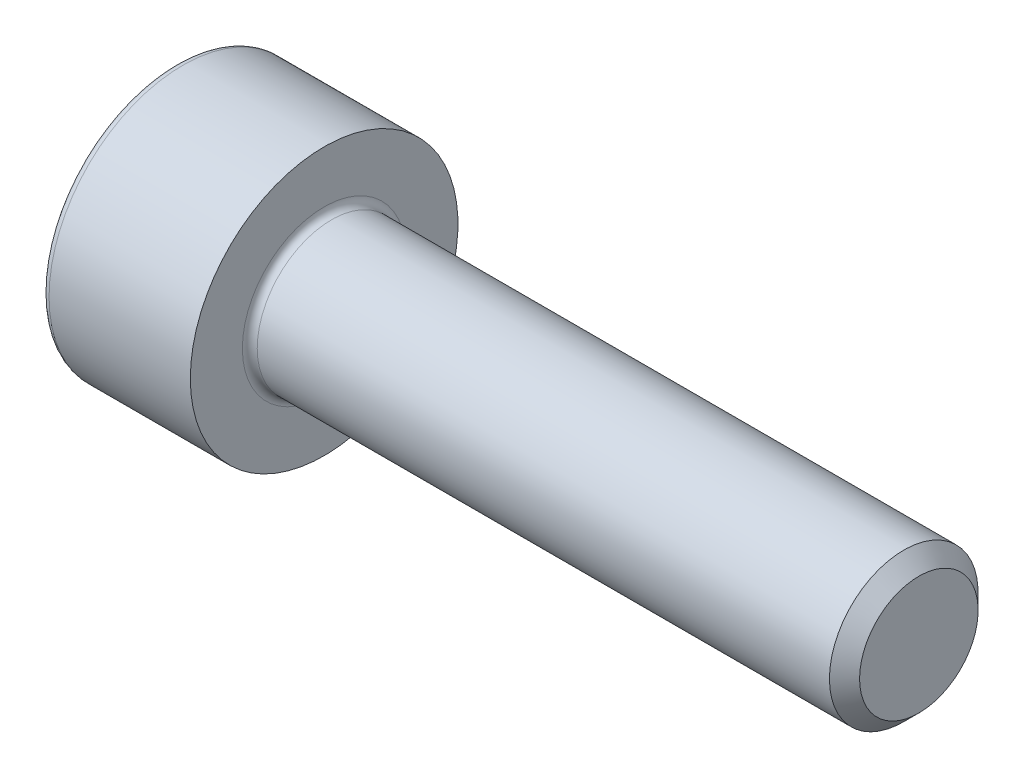
ISO-10303-21;
HEADER;
FILE_DESCRIPTION(('STEP AP214'),'2;1');
FILE_NAME('part.step','',(''),(''),'','','');
FILE_SCHEMA(('AUTOMOTIVE_DESIGN { 1 0 10303 214 1 1 1 1 }'));
ENDSEC;
DATA;
#1=APPLICATION_CONTEXT('core data for automotive mechanical design processes');
#2=APPLICATION_PROTOCOL_DEFINITION('international standard','automotive_design',2000,#1);
#3=PRODUCT_CONTEXT('',#1,'mechanical');
#4=PRODUCT('Part','Part','',(#3));
#5=PRODUCT_RELATED_PRODUCT_CATEGORY('part','',(#4));
#6=PRODUCT_DEFINITION_FORMATION('','',#4);
#7=PRODUCT_DEFINITION_CONTEXT('part definition',#1,'design');
#8=PRODUCT_DEFINITION('design','',#6,#7);
#9=PRODUCT_DEFINITION_SHAPE('','',#8);
#10=(LENGTH_UNIT() NAMED_UNIT(*) SI_UNIT(.MILLI.,.METRE.));
#11=(NAMED_UNIT(*) PLANE_ANGLE_UNIT() SI_UNIT($,.RADIAN.));
#12=(NAMED_UNIT(*) SI_UNIT($,.STERADIAN.) SOLID_ANGLE_UNIT());
#13=UNCERTAINTY_MEASURE_WITH_UNIT(LENGTH_MEASURE(1.E-05),#10,'distance_accuracy_value','');
#14=(GEOMETRIC_REPRESENTATION_CONTEXT(3) GLOBAL_UNCERTAINTY_ASSIGNED_CONTEXT((#13)) GLOBAL_UNIT_ASSIGNED_CONTEXT((#10,
#11,#12)) REPRESENTATION_CONTEXT('',''));
#15=CARTESIAN_POINT('',(0.,0.,0.));
#16=DIRECTION('',(0.,0.,1.));
#17=DIRECTION('',(1.,0.,0.));
#18=AXIS2_PLACEMENT_3D('',#15,#16,#17);
#19=CARTESIAN_POINT('',(10.,0.,0.));
#20=DIRECTION('',(-1.,0.,0.));
#21=DIRECTION('',(0.,0.,1.));
#22=AXIS2_PLACEMENT_3D('',#19,#20,#21);
#23=CONICAL_SURFACE('',#22,0.996499999993504,0.785398163397451);
#24=CARTESIAN_POINT('',(9.7464999999935,0.,0.));
#25=DIRECTION('',(-1.,0.,0.));
#26=DIRECTION('',(0.,0.,1.));
#27=AXIS2_PLACEMENT_3D('',#24,#25,#26);
#28=CIRCLE('',#27,1.25);
#29=CARTESIAN_POINT('',(9.7464999999935,0.,1.25));
#30=VERTEX_POINT('',#29);
#31=EDGE_CURVE('E11',#30,#30,#28,.T.);
#32=ORIENTED_EDGE('',*,*,#31,.F.);
#33=EDGE_LOOP('',(#32));
#34=FACE_BOUND('',#33,.T.);
#35=CARTESIAN_POINT('',(10.,0.,0.));
#36=DIRECTION('',(-1.,0.,0.));
#37=DIRECTION('',(0.,0.,1.));
#38=AXIS2_PLACEMENT_3D('',#35,#36,#37);
#39=CIRCLE('',#38,0.996499999993504);
#40=CARTESIAN_POINT('',(10.,0.,0.996499999993504));
#41=VERTEX_POINT('',#40);
#42=EDGE_CURVE('E134',#41,#41,#39,.T.);
#43=ORIENTED_EDGE('',*,*,#42,.T.);
#44=EDGE_LOOP('',(#43));
#45=FACE_BOUND('',#44,.T.);
#46=ADVANCED_FACE('F33',(#34,#45),#23,.T.);
#47=CARTESIAN_POINT('',(-2.5,0.,0.));
#48=DIRECTION('',(-1.,0.,0.));
#49=DIRECTION('',(0.,0.,1.));
#50=AXIS2_PLACEMENT_3D('',#47,#48,#49);
#51=CYLINDRICAL_SURFACE('',#50,1.25);
#52=CARTESIAN_POINT('',(0.125,0.,0.));
#53=DIRECTION('',(-1.,0.,0.));
#54=DIRECTION('',(0.,0.,1.));
#55=AXIS2_PLACEMENT_3D('',#52,#53,#54);
#56=CIRCLE('',#55,1.25);
#57=CARTESIAN_POINT('',(0.125,0.,1.25));
#58=VERTEX_POINT('',#57);
#59=EDGE_CURVE('E40',#58,#58,#56,.T.);
#60=ORIENTED_EDGE('',*,*,#59,.F.);
#61=EDGE_LOOP('',(#60));
#62=FACE_BOUND('',#61,.T.);
#63=ORIENTED_EDGE('',*,*,#31,.T.);
#64=EDGE_LOOP('',(#63));
#65=FACE_BOUND('',#64,.T.);
#66=ADVANCED_FACE('F158',(#62,#65),#51,.T.);
#67=CARTESIAN_POINT('',(0.125,0.,0.));
#68=DIRECTION('',(-1.,0.,0.));
#69=DIRECTION('',(0.,0.,1.));
#70=AXIS2_PLACEMENT_3D('',#67,#68,#69);
#71=TOROIDAL_SURFACE('',#70,1.375,0.125);
#72=CARTESIAN_POINT('',(0.,0.,0.));
#73=DIRECTION('',(-1.,0.,0.));
#74=DIRECTION('',(0.,0.,1.));
#75=AXIS2_PLACEMENT_3D('',#72,#73,#74);
#76=CIRCLE('',#75,1.375);
#77=CARTESIAN_POINT('',(0.,0.,1.375));
#78=VERTEX_POINT('',#77);
#79=EDGE_CURVE('E151',#78,#78,#76,.T.);
#80=ORIENTED_EDGE('',*,*,#79,.F.);
#81=EDGE_LOOP('',(#80));
#82=FACE_BOUND('',#81,.T.);
#83=ORIENTED_EDGE('',*,*,#59,.T.);
#84=EDGE_LOOP('',(#83));
#85=FACE_BOUND('',#84,.T.);
#86=ADVANCED_FACE('F156',(#82,#85),#71,.F.);
#87=CARTESIAN_POINT('',(0.,1.375,0.));
#88=DIRECTION('',(-1.,0.,0.));
#89=DIRECTION('',(0.,0.,1.));
#90=AXIS2_PLACEMENT_3D('',#87,#88,#89);
#91=PLANE('',#90);
#92=CARTESIAN_POINT('',(0.,0.,0.));
#93=DIRECTION('',(-1.,0.,0.));
#94=DIRECTION('',(0.,0.,1.));
#95=AXIS2_PLACEMENT_3D('',#92,#93,#94);
#96=CIRCLE('',#95,2.25);
#97=CARTESIAN_POINT('',(0.,0.,2.25));
#98=VERTEX_POINT('',#97);
#99=EDGE_CURVE('E148',#98,#98,#96,.T.);
#100=ORIENTED_EDGE('',*,*,#99,.F.);
#101=EDGE_LOOP('',(#100));
#102=FACE_BOUND('',#101,.T.);
#103=ORIENTED_EDGE('',*,*,#79,.T.);
#104=EDGE_LOOP('',(#103));
#105=FACE_BOUND('',#104,.T.);
#106=ADVANCED_FACE('F189',(#102,#105),#91,.F.);
#107=CARTESIAN_POINT('',(-2.5,0.,0.));
#108=DIRECTION('',(-1.,0.,0.));
#109=DIRECTION('',(0.,0.,1.));
#110=AXIS2_PLACEMENT_3D('',#107,#108,#109);
#111=CYLINDRICAL_SURFACE('',#110,2.25);
#112=CARTESIAN_POINT('',(-2.375,0.,0.));
#113=DIRECTION('',(-1.,0.,0.));
#114=DIRECTION('',(0.,0.,1.));
#115=AXIS2_PLACEMENT_3D('',#112,#113,#114);
#116=CIRCLE('',#115,2.25);
#117=CARTESIAN_POINT('',(-2.375,0.,2.25));
#118=VERTEX_POINT('',#117);
#119=EDGE_CURVE('E145',#118,#118,#116,.T.);
#120=ORIENTED_EDGE('',*,*,#119,.F.);
#121=EDGE_LOOP('',(#120));
#122=FACE_BOUND('',#121,.T.);
#123=ORIENTED_EDGE('',*,*,#99,.T.);
#124=EDGE_LOOP('',(#123));
#125=FACE_BOUND('',#124,.T.);
#126=ADVANCED_FACE('F185',(#122,#125),#111,.T.);
#127=CARTESIAN_POINT('',(-2.375,0.,0.));
#128=DIRECTION('',(-1.,0.,0.));
#129=DIRECTION('',(0.,0.,1.));
#130=AXIS2_PLACEMENT_3D('',#127,#128,#129);
#131=TOROIDAL_SURFACE('',#130,2.125,0.125);
#132=CARTESIAN_POINT('',(-2.5,0.,0.));
#133=DIRECTION('',(-1.,0.,0.));
#134=DIRECTION('',(0.,0.,1.));
#135=AXIS2_PLACEMENT_3D('',#132,#133,#134);
#136=CIRCLE('',#135,2.125);
#137=CARTESIAN_POINT('',(-2.5,0.,2.125));
#138=VERTEX_POINT('',#137);
#139=EDGE_CURVE('E142',#138,#138,#136,.T.);
#140=ORIENTED_EDGE('',*,*,#139,.F.);
#141=EDGE_LOOP('',(#140));
#142=FACE_BOUND('',#141,.T.);
#143=ORIENTED_EDGE('',*,*,#119,.T.);
#144=EDGE_LOOP('',(#143));
#145=FACE_BOUND('',#144,.T.);
#146=ADVANCED_FACE('F178',(#142,#145),#131,.T.);
#147=CARTESIAN_POINT('',(-2.5,2.125,0.));
#148=DIRECTION('',(1.,0.,0.));
#149=DIRECTION('',(0.,0.,-1.));
#150=AXIS2_PLACEMENT_3D('',#147,#148,#149);
#151=PLANE('',#150);
#152=DIRECTION('',(0.,0.5,-0.866025403784438));
#153=VECTOR('',#152,1.);
#154=CARTESIAN_POINT('',(-2.5,0.591784025919366,1.025));
#155=LINE('',#154,#153);
#156=CARTESIAN_POINT('',(-2.5,0.591784025919366,1.025));
#157=VERTEX_POINT('',#156);
#158=CARTESIAN_POINT('',(-2.5,1.18356805183873,0.));
#159=VERTEX_POINT('',#158);
#160=EDGE_CURVE('E121',#157,#159,#155,.T.);
#161=ORIENTED_EDGE('',*,*,#160,.F.);
#162=DIRECTION('',(0.,1.,0.));
#163=VECTOR('',#162,1.);
#164=CARTESIAN_POINT('',(-2.5,-0.591784025919367,1.025));
#165=LINE('',#164,#163);
#166=CARTESIAN_POINT('',(-2.5,-0.591784025919367,1.025));
#167=VERTEX_POINT('',#166);
#168=EDGE_CURVE('E47',#167,#157,#165,.T.);
#169=ORIENTED_EDGE('',*,*,#168,.F.);
#170=DIRECTION('',(0.,0.5,0.866025403784439));
#171=VECTOR('',#170,1.);
#172=CARTESIAN_POINT('',(-2.5,-1.18356805183873,0.));
#173=LINE('',#172,#171);
#174=CARTESIAN_POINT('',(-2.5,-1.18356805183873,0.));
#175=VERTEX_POINT('',#174);
#176=EDGE_CURVE('E130',#175,#167,#173,.T.);
#177=ORIENTED_EDGE('',*,*,#176,.F.);
#178=DIRECTION('',(0.,-0.5,0.866025403784438));
#179=VECTOR('',#178,1.);
#180=CARTESIAN_POINT('',(-2.5,-0.591784025919366,-1.025));
#181=LINE('',#180,#179);
#182=CARTESIAN_POINT('',(-2.5,-0.591784025919366,-1.025));
#183=VERTEX_POINT('',#182);
#184=EDGE_CURVE('E128',#183,#175,#181,.T.);
#185=ORIENTED_EDGE('',*,*,#184,.F.);
#186=DIRECTION('',(0.,-1.,0.));
#187=VECTOR('',#186,1.);
#188=CARTESIAN_POINT('',(-2.5,0.591784025919367,-1.025));
#189=LINE('',#188,#187);
#190=CARTESIAN_POINT('',(-2.5,0.591784025919367,-1.025));
#191=VERTEX_POINT('',#190);
#192=EDGE_CURVE('E95',#191,#183,#189,.T.);
#193=ORIENTED_EDGE('',*,*,#192,.F.);
#194=DIRECTION('',(0.,-0.5,-0.866025403784439));
#195=VECTOR('',#194,1.);
#196=CARTESIAN_POINT('',(-2.5,1.18356805183873,0.));
#197=LINE('',#196,#195);
#198=EDGE_CURVE('E124',#159,#191,#197,.T.);
#199=ORIENTED_EDGE('',*,*,#198,.F.);
#200=EDGE_LOOP('',(#161,#169,#177,#185,#193,#199));
#201=FACE_BOUND('',#200,.T.);
#202=ORIENTED_EDGE('',*,*,#139,.T.);
#203=EDGE_LOOP('',(#202));
#204=FACE_BOUND('',#203,.T.);
#205=ADVANCED_FACE('F170',(#201,#204),#151,.F.);
#206=CARTESIAN_POINT('',(10.,0.996499999993504,0.));
#207=DIRECTION('',(-1.,0.,0.));
#208=DIRECTION('',(0.,0.,1.));
#209=AXIS2_PLACEMENT_3D('',#206,#207,#208);
#210=PLANE('',#209);
#211=ORIENTED_EDGE('',*,*,#42,.F.);
#212=EDGE_LOOP('',(#211));
#213=FACE_BOUND('',#212,.T.);
#214=ADVANCED_FACE('F167',(#213),#210,.F.);
#215=CARTESIAN_POINT('',(-1.4,-0.591784025919367,1.025));
#216=DIRECTION('',(0.,0.,1.));
#217=DIRECTION('',(1.,0.,0.));
#218=AXIS2_PLACEMENT_3D('',#215,#216,#217);
#219=PLANE('',#218);
#220=ORIENTED_EDGE('',*,*,#168,.T.);
#221=DIRECTION('',(-1.,0.,0.));
#222=VECTOR('',#221,1.);
#223=CARTESIAN_POINT('',(-1.4,0.591784025919366,1.025));
#224=LINE('',#223,#222);
#225=CARTESIAN_POINT('',(-1.4,0.591784025919366,1.025));
#226=VERTEX_POINT('',#225);
#227=EDGE_CURVE('E77',#226,#157,#224,.T.);
#228=ORIENTED_EDGE('',*,*,#227,.F.);
#229=DIRECTION('',(0.,1.,0.));
#230=VECTOR('',#229,1.);
#231=CARTESIAN_POINT('',(-1.4,-0.591784025919367,1.025));
#232=LINE('',#231,#230);
#233=CARTESIAN_POINT('',(-1.4,-0.591784025919367,1.025));
#234=VERTEX_POINT('',#233);
#235=EDGE_CURVE('E132',#234,#226,#232,.T.);
#236=ORIENTED_EDGE('',*,*,#235,.F.);
#237=DIRECTION('',(-1.,0.,0.));
#238=VECTOR('',#237,1.);
#239=CARTESIAN_POINT('',(-1.4,-0.591784025919367,1.025));
#240=LINE('',#239,#238);
#241=EDGE_CURVE('E55',#234,#167,#240,.T.);
#242=ORIENTED_EDGE('',*,*,#241,.T.);
#243=EDGE_LOOP('',(#220,#228,#236,#242));
#244=FACE_BOUND('',#243,.T.);
#245=ADVANCED_FACE('F169',(#244),#219,.F.);
#246=CARTESIAN_POINT('',(-1.4,-1.18356805183873,0.));
#247=DIRECTION('',(0.,-0.866025403784439,0.5));
#248=DIRECTION('',(0.,-0.5,-0.866025403784439));
#249=AXIS2_PLACEMENT_3D('',#246,#247,#248);
#250=PLANE('',#249);
#251=ORIENTED_EDGE('',*,*,#176,.T.);
#252=ORIENTED_EDGE('',*,*,#241,.F.);
#253=DIRECTION('',(0.,0.5,0.866025403784439));
#254=VECTOR('',#253,1.);
#255=CARTESIAN_POINT('',(-1.4,-1.18356805183873,0.));
#256=LINE('',#255,#254);
#257=CARTESIAN_POINT('',(-1.4,-1.18356805183873,0.));
#258=VERTEX_POINT('',#257);
#259=EDGE_CURVE('E107',#258,#234,#256,.T.);
#260=ORIENTED_EDGE('',*,*,#259,.F.);
#261=DIRECTION('',(-1.,0.,0.));
#262=VECTOR('',#261,1.);
#263=CARTESIAN_POINT('',(-1.4,-1.18356805183873,0.));
#264=LINE('',#263,#262);
#265=EDGE_CURVE('E99',#258,#175,#264,.T.);
#266=ORIENTED_EDGE('',*,*,#265,.T.);
#267=EDGE_LOOP('',(#251,#252,#260,#266));
#268=FACE_BOUND('',#267,.T.);
#269=ADVANCED_FACE('F176',(#268),#250,.F.);
#270=CARTESIAN_POINT('',(-1.4,-0.591784025919366,-1.025));
#271=DIRECTION('',(0.,-0.866025403784439,-0.5));
#272=DIRECTION('',(0.,0.5,-0.866025403784438));
#273=AXIS2_PLACEMENT_3D('',#270,#271,#272);
#274=PLANE('',#273);
#275=ORIENTED_EDGE('',*,*,#184,.T.);
#276=ORIENTED_EDGE('',*,*,#265,.F.);
#277=DIRECTION('',(0.,-0.5,0.866025403784438));
#278=VECTOR('',#277,1.);
#279=CARTESIAN_POINT('',(-1.4,-0.591784025919366,-1.025));
#280=LINE('',#279,#278);
#281=CARTESIAN_POINT('',(-1.4,-0.591784025919366,-1.025));
#282=VERTEX_POINT('',#281);
#283=EDGE_CURVE('E103',#282,#258,#280,.T.);
#284=ORIENTED_EDGE('',*,*,#283,.F.);
#285=DIRECTION('',(-1.,0.,0.));
#286=VECTOR('',#285,1.);
#287=CARTESIAN_POINT('',(-1.4,-0.591784025919366,-1.025));
#288=LINE('',#287,#286);
#289=EDGE_CURVE('E88',#282,#183,#288,.T.);
#290=ORIENTED_EDGE('',*,*,#289,.T.);
#291=EDGE_LOOP('',(#275,#276,#284,#290));
#292=FACE_BOUND('',#291,.T.);
#293=ADVANCED_FACE('F104',(#292),#274,.F.);
#294=CARTESIAN_POINT('',(-1.4,0.591784025919367,-1.025));
#295=DIRECTION('',(0.,0.,-1.));
#296=DIRECTION('',(-1.,0.,0.));
#297=AXIS2_PLACEMENT_3D('',#294,#295,#296);
#298=PLANE('',#297);
#299=ORIENTED_EDGE('',*,*,#192,.T.);
#300=ORIENTED_EDGE('',*,*,#289,.F.);
#301=DIRECTION('',(0.,-1.,0.));
#302=VECTOR('',#301,1.);
#303=CARTESIAN_POINT('',(-1.4,0.591784025919367,-1.025));
#304=LINE('',#303,#302);
#305=CARTESIAN_POINT('',(-1.4,0.591784025919367,-1.025));
#306=VERTEX_POINT('',#305);
#307=EDGE_CURVE('E92',#306,#282,#304,.T.);
#308=ORIENTED_EDGE('',*,*,#307,.F.);
#309=DIRECTION('',(-1.,0.,0.));
#310=VECTOR('',#309,1.);
#311=CARTESIAN_POINT('',(-1.4,0.591784025919367,-1.025));
#312=LINE('',#311,#310);
#313=EDGE_CURVE('E100',#306,#191,#312,.T.);
#314=ORIENTED_EDGE('',*,*,#313,.T.);
#315=EDGE_LOOP('',(#299,#300,#308,#314));
#316=FACE_BOUND('',#315,.T.);
#317=ADVANCED_FACE('F90',(#316),#298,.F.);
#318=CARTESIAN_POINT('',(-1.4,1.18356805183873,0.));
#319=DIRECTION('',(0.,0.866025403784439,-0.5));
#320=DIRECTION('',(0.,0.5,0.866025403784439));
#321=AXIS2_PLACEMENT_3D('',#318,#319,#320);
#322=PLANE('',#321);
#323=ORIENTED_EDGE('',*,*,#198,.T.);
#324=ORIENTED_EDGE('',*,*,#313,.F.);
#325=DIRECTION('',(0.,-0.5,-0.866025403784439));
#326=VECTOR('',#325,1.);
#327=CARTESIAN_POINT('',(-1.4,1.18356805183873,0.));
#328=LINE('',#327,#326);
#329=CARTESIAN_POINT('',(-1.4,1.18356805183873,0.));
#330=VERTEX_POINT('',#329);
#331=EDGE_CURVE('E113',#330,#306,#328,.T.);
#332=ORIENTED_EDGE('',*,*,#331,.F.);
#333=DIRECTION('',(-1.,0.,0.));
#334=VECTOR('',#333,1.);
#335=CARTESIAN_POINT('',(-1.4,1.18356805183873,0.));
#336=LINE('',#335,#334);
#337=EDGE_CURVE('E137',#330,#159,#336,.T.);
#338=ORIENTED_EDGE('',*,*,#337,.T.);
#339=EDGE_LOOP('',(#323,#324,#332,#338));
#340=FACE_BOUND('',#339,.T.);
#341=ADVANCED_FACE('F251',(#340),#322,.F.);
#342=CARTESIAN_POINT('',(-1.4,0.591784025919366,1.025));
#343=DIRECTION('',(0.,0.866025403784439,0.5));
#344=DIRECTION('',(0.,-0.5,0.866025403784438));
#345=AXIS2_PLACEMENT_3D('',#342,#343,#344);
#346=PLANE('',#345);
#347=ORIENTED_EDGE('',*,*,#160,.T.);
#348=ORIENTED_EDGE('',*,*,#337,.F.);
#349=DIRECTION('',(0.,0.5,-0.866025403784438));
#350=VECTOR('',#349,1.);
#351=CARTESIAN_POINT('',(-1.4,0.591784025919366,1.025));
#352=LINE('',#351,#350);
#353=EDGE_CURVE('E115',#226,#330,#352,.T.);
#354=ORIENTED_EDGE('',*,*,#353,.F.);
#355=ORIENTED_EDGE('',*,*,#227,.T.);
#356=EDGE_LOOP('',(#347,#348,#354,#355));
#357=FACE_BOUND('',#356,.T.);
#358=ADVANCED_FACE('F260',(#357),#346,.F.);
#359=CARTESIAN_POINT('',(-1.4,0.,0.));
#360=DIRECTION('',(-1.,0.,0.));
#361=DIRECTION('',(0.,0.,1.));
#362=AXIS2_PLACEMENT_3D('',#359,#360,#361);
#363=PLANE('',#362);
#364=ORIENTED_EDGE('',*,*,#235,.T.);
#365=ORIENTED_EDGE('',*,*,#353,.T.);
#366=ORIENTED_EDGE('',*,*,#331,.T.);
#367=ORIENTED_EDGE('',*,*,#307,.T.);
#368=ORIENTED_EDGE('',*,*,#283,.T.);
#369=ORIENTED_EDGE('',*,*,#259,.T.);
#370=EDGE_LOOP('',(#364,#365,#366,#367,#368,#369));
#371=FACE_BOUND('',#370,.T.);
#372=ADVANCED_FACE('F110',(#371),#363,.T.);
#373=CLOSED_SHELL('',(#46,#66,#86,#106,#126,#146,#205,#214,#245,#269,#293,#317,#341,#358,#372));
#374=MANIFOLD_SOLID_BREP('B2',#373);
#375=ADVANCED_BREP_SHAPE_REPRESENTATION('',(#18,#374),#14);
#376=SHAPE_DEFINITION_REPRESENTATION(#9,#375);
ENDSEC;
END-ISO-10303-21;
